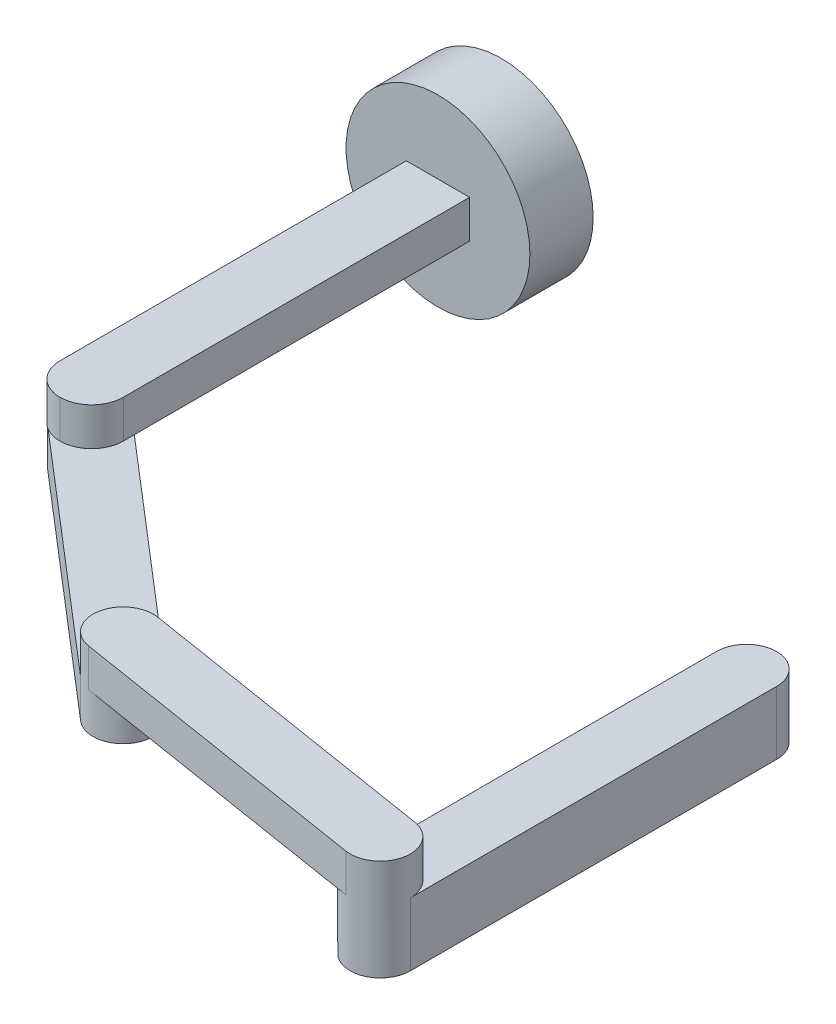
ISO-10303-21;
HEADER;
FILE_DESCRIPTION(('STEP AP214'),'2;1');
FILE_NAME('part.step','',(''),(''),'','','');
FILE_SCHEMA(('AUTOMOTIVE_DESIGN { 1 0 10303 214 1 1 1 1 }'));
ENDSEC;
DATA;
#1=APPLICATION_CONTEXT('core data for automotive mechanical design processes');
#2=APPLICATION_PROTOCOL_DEFINITION('international standard','automotive_design',2000,#1);
#3=PRODUCT_CONTEXT('',#1,'mechanical');
#4=PRODUCT('Part','Part','',(#3));
#5=PRODUCT_RELATED_PRODUCT_CATEGORY('part','',(#4));
#6=PRODUCT_DEFINITION_FORMATION('','',#4);
#7=PRODUCT_DEFINITION_CONTEXT('part definition',#1,'design');
#8=PRODUCT_DEFINITION('design','',#6,#7);
#9=PRODUCT_DEFINITION_SHAPE('','',#8);
#10=(LENGTH_UNIT() NAMED_UNIT(*) SI_UNIT(.MILLI.,.METRE.));
#11=(NAMED_UNIT(*) PLANE_ANGLE_UNIT() SI_UNIT($,.RADIAN.));
#12=(NAMED_UNIT(*) SI_UNIT($,.STERADIAN.) SOLID_ANGLE_UNIT());
#13=UNCERTAINTY_MEASURE_WITH_UNIT(LENGTH_MEASURE(1.E-05),#10,'distance_accuracy_value','');
#14=(GEOMETRIC_REPRESENTATION_CONTEXT(3) GLOBAL_UNCERTAINTY_ASSIGNED_CONTEXT((#13)) GLOBAL_UNIT_ASSIGNED_CONTEXT((#10,
#11,#12)) REPRESENTATION_CONTEXT('',''));
#15=CARTESIAN_POINT('',(0.,0.,0.));
#16=DIRECTION('',(0.,0.,1.));
#17=DIRECTION('',(1.,0.,0.));
#18=AXIS2_PLACEMENT_3D('',#15,#16,#17);
#19=CARTESIAN_POINT('',(74.107497333649,-6.,173.642023366564));
#20=DIRECTION('',(0.,1.,0.));
#21=DIRECTION('',(0.,0.,1.));
#22=AXIS2_PLACEMENT_3D('',#19,#20,#21);
#23=PLANE('',#22);
#24=CARTESIAN_POINT('',(170.904143157306,-6.,189.143321934411));
#25=DIRECTION('',(0.,-1.,0.));
#26=DIRECTION('',(0.,0.,-1.));
#27=AXIS2_PLACEMENT_3D('',#24,#25,#26);
#28=CIRCLE('',#27,9.52576624332074);
#29=CARTESIAN_POINT('',(169.397851750336,-6.,198.549240747567));
#30=VERTEX_POINT('',#29);
#31=CARTESIAN_POINT('',(161.378376913985,-6.,189.143321934411));
#32=VERTEX_POINT('',#31);
#33=EDGE_CURVE('E198',#30,#32,#28,.T.);
#34=ORIENTED_EDGE('',*,*,#33,.F.);
#35=DIRECTION('',(0.987418604750145,0.,0.158128109434332));
#36=VECTOR('',#35,1.);
#37=CARTESIAN_POINT('',(72.6012059266793,-6.,183.04794217972));
#38=LINE('',#37,#36);
#39=CARTESIAN_POINT('',(72.6012059266793,-6.,183.04794217972));
#40=VERTEX_POINT('',#39);
#41=EDGE_CURVE('E220',#40,#30,#38,.T.);
#42=ORIENTED_EDGE('',*,*,#41,.F.);
#43=CARTESIAN_POINT('',(74.107497333649,-6.,173.642023366564));
#44=DIRECTION('',(0.,-1.,0.));
#45=DIRECTION('',(0.,0.,1.));
#46=AXIS2_PLACEMENT_3D('',#43,#44,#45);
#47=CIRCLE('',#46,9.52576624332077);
#48=CARTESIAN_POINT('',(80.3150769859035,-6.,166.416639128802));
#49=VERTEX_POINT('',#48);
#50=EDGE_CURVE('E257',#49,#40,#47,.T.);
#51=ORIENTED_EDGE('',*,*,#50,.F.);
#52=DIRECTION('',(0.758509504978529,0.,0.651661975917904));
#53=VECTOR('',#52,1.);
#54=CARTESIAN_POINT('',(6.20869834950109,-6.,102.749264081622));
#55=LINE('',#54,#53);
#56=CARTESIAN_POINT('',(78.2726264406478,-6.,164.661898615598));
#57=VERTEX_POINT('',#56);
#58=EDGE_CURVE('E253',#57,#49,#55,.T.);
#59=ORIENTED_EDGE('',*,*,#58,.F.);
#60=DIRECTION('',(-0.987418604750146,0.,-0.158128109434332));
#61=VECTOR('',#60,1.);
#62=CARTESIAN_POINT('',(75.6137887406186,-6.,164.236104553408));
#63=LINE('',#62,#61);
#64=CARTESIAN_POINT('',(161.378376913985,-6.,177.970697074784));
#65=VERTEX_POINT('',#64);
#66=EDGE_CURVE('E60',#65,#57,#63,.T.);
#67=ORIENTED_EDGE('',*,*,#66,.F.);
#68=DIRECTION('',(0.,0.,-1.));
#69=VECTOR('',#68,1.);
#70=CARTESIAN_POINT('',(161.378376913985,-6.,189.143321934411));
#71=LINE('',#70,#69);
#72=EDGE_CURVE('E53',#32,#65,#71,.T.);
#73=ORIENTED_EDGE('',*,*,#72,.F.);
#74=EDGE_LOOP('',(#34,#42,#51,#59,#67,#73));
#75=FACE_BOUND('',#74,.T.);
#76=ADVANCED_FACE('F38',(#75),#23,.F.);
#77=CARTESIAN_POINT('',(0.,-6.,109.975950440003));
#78=DIRECTION('',(0.,-1.,0.));
#79=DIRECTION('',(0.,0.,-1.));
#80=AXIS2_PLACEMENT_3D('',#77,#78,#79);
#81=PLANE('',#80);
#82=CARTESIAN_POINT('',(74.107497333649,-6.,173.642023366564));
#83=DIRECTION('',(0.,1.,0.));
#84=DIRECTION('',(0.,0.,1.));
#85=AXIS2_PLACEMENT_3D('',#82,#83,#84);
#86=CIRCLE('',#85,9.52576624332076);
#87=CARTESIAN_POINT('',(75.6137887406186,-6.,164.236104553408));
#88=VERTEX_POINT('',#87);
#89=CARTESIAN_POINT('',(67.8999176813945,-6.,180.867407604326));
#90=VERTEX_POINT('',#89);
#91=EDGE_CURVE('E201',#88,#90,#86,.T.);
#92=ORIENTED_EDGE('',*,*,#91,.F.);
#93=DIRECTION('',(-0.987418604750146,0.,-0.158128109434332));
#94=VECTOR('',#93,1.);
#95=CARTESIAN_POINT('',(-6.58142161251279,-6.,151.073122657815));
#96=LINE('',#95,#94);
#97=EDGE_CURVE('E12',#57,#88,#96,.T.);
#98=ORIENTED_EDGE('',*,*,#97,.F.);
#99=CARTESIAN_POINT('',(10.,-6.,106.006503587059));
#100=VERTEX_POINT('',#99);
#101=EDGE_CURVE('E258',#100,#57,#55,.T.);
#102=ORIENTED_EDGE('',*,*,#101,.F.);
#103=DIRECTION('',(0.,0.,-1.));
#104=VECTOR('',#103,1.);
#105=CARTESIAN_POINT('',(10.,-6.,119.5));
#106=LINE('',#105,#104);
#107=CARTESIAN_POINT('',(10.,-6.,109.5));
#108=VERTEX_POINT('',#107);
#109=EDGE_CURVE('E280',#108,#100,#106,.T.);
#110=ORIENTED_EDGE('',*,*,#109,.F.);
#111=CARTESIAN_POINT('',(0.,-6.,109.5));
#112=DIRECTION('',(0.,-1.,0.));
#113=DIRECTION('',(0.,0.,-1.));
#114=AXIS2_PLACEMENT_3D('',#111,#112,#113);
#115=CIRCLE('',#114,10.);
#116=CARTESIAN_POINT('',(0.,-6.,119.5));
#117=VERTEX_POINT('',#116);
#118=EDGE_CURVE('E312',#108,#117,#115,.T.);
#119=ORIENTED_EDGE('',*,*,#118,.T.);
#120=CARTESIAN_POINT('',(0.,-6.,109.5));
#121=DIRECTION('',(0.,-1.,0.));
#122=DIRECTION('',(0.,0.,-1.));
#123=AXIS2_PLACEMENT_3D('',#120,#121,#122);
#124=CIRCLE('',#123,10.);
#125=CARTESIAN_POINT('',(-5.29500461699873,-6.,117.983096492789));
#126=VERTEX_POINT('',#125);
#127=EDGE_CURVE('E316',#117,#126,#124,.T.);
#128=ORIENTED_EDGE('',*,*,#127,.T.);
#129=DIRECTION('',(-0.75850950497853,0.,-0.651661975917904));
#130=VECTOR('',#129,1.);
#131=CARTESIAN_POINT('',(-6.20646095500788,-6.,117.200032557147));
#132=LINE('',#131,#130);
#133=EDGE_CURVE('E239',#90,#126,#132,.T.);
#134=ORIENTED_EDGE('',*,*,#133,.F.);
#135=EDGE_LOOP('',(#92,#98,#102,#110,#119,#128,#134));
#136=FACE_BOUND('',#135,.T.);
#137=ADVANCED_FACE('F353',(#136),#81,.F.);
#138=CARTESIAN_POINT('',(10.,-6.,119.5));
#139=DIRECTION('',(0.,-1.,0.));
#140=DIRECTION('',(0.,0.,-1.));
#141=AXIS2_PLACEMENT_3D('',#138,#139,#140);
#142=PLANE('',#141);
#143=CARTESIAN_POINT('',(10.,-6.,0.));
#144=VERTEX_POINT('',#143);
#145=EDGE_CURVE('E283',#100,#144,#106,.T.);
#146=ORIENTED_EDGE('',*,*,#145,.F.);
#147=CARTESIAN_POINT('',(6.20869834950109,-6.,102.749264081622));
#148=VERTEX_POINT('',#147);
#149=EDGE_CURVE('E254',#148,#100,#55,.T.);
#150=ORIENTED_EDGE('',*,*,#149,.F.);
#151=DIRECTION('',(0.651661975918026,0.,-0.758509504978424));
#152=VECTOR('',#151,1.);
#153=CARTESIAN_POINT('',(6.20869834950109,-6.,102.749264081622));
#154=LINE('',#153,#152);
#155=CARTESIAN_POINT('',(6.20646095500788,-6.,102.751868322858));
#156=VERTEX_POINT('',#155);
#157=EDGE_CURVE('E250',#156,#148,#154,.T.);
#158=ORIENTED_EDGE('',*,*,#157,.F.);
#159=CARTESIAN_POINT('',(0.,-6.,109.975950440003));
#160=DIRECTION('',(0.,-1.,0.));
#161=DIRECTION('',(0.,0.,-1.));
#162=AXIS2_PLACEMENT_3D('',#159,#160,#161);
#163=CIRCLE('',#162,9.5240495599973);
#164=CARTESIAN_POINT('',(-6.20646095500788,-6.,117.200032557147));
#165=VERTEX_POINT('',#164);
#166=EDGE_CURVE('E234',#165,#156,#163,.T.);
#167=ORIENTED_EDGE('',*,*,#166,.F.);
#168=EDGE_CURVE('E260',#126,#165,#132,.T.);
#169=ORIENTED_EDGE('',*,*,#168,.F.);
#170=CARTESIAN_POINT('',(-10.,-6.,109.5));
#171=VERTEX_POINT('',#170);
#172=EDGE_CURVE('E315',#126,#171,#124,.T.);
#173=ORIENTED_EDGE('',*,*,#172,.T.);
#174=DIRECTION('',(0.,0.,-1.));
#175=VECTOR('',#174,1.);
#176=CARTESIAN_POINT('',(-10.,-6.,119.5));
#177=LINE('',#176,#175);
#178=CARTESIAN_POINT('',(-10.,-6.,0.));
#179=VERTEX_POINT('',#178);
#180=EDGE_CURVE('E277',#171,#179,#177,.T.);
#181=ORIENTED_EDGE('',*,*,#180,.T.);
#182=DIRECTION('',(1.,0.,0.));
#183=VECTOR('',#182,1.);
#184=CARTESIAN_POINT('',(0.,-6.,0.));
#185=LINE('',#184,#183);
#186=EDGE_CURVE('E299',#179,#144,#185,.T.);
#187=ORIENTED_EDGE('',*,*,#186,.T.);
#188=EDGE_LOOP('',(#146,#150,#158,#167,#169,#173,#181,#187));
#189=FACE_BOUND('',#188,.T.);
#190=ADVANCED_FACE('F343',(#189),#142,.T.);
#191=CARTESIAN_POINT('',(0.,0.,-20.));
#192=DIRECTION('',(0.,0.,1.));
#193=DIRECTION('',(1.,0.,0.));
#194=AXIS2_PLACEMENT_3D('',#191,#192,#193);
#195=CYLINDRICAL_SURFACE('',#194,29.0608485526525);
#196=CARTESIAN_POINT('',(0.,0.,-20.));
#197=DIRECTION('',(0.,0.,1.));
#198=DIRECTION('',(1.,0.,0.));
#199=AXIS2_PLACEMENT_3D('',#196,#197,#198);
#200=CIRCLE('',#199,29.0608485526525);
#201=CARTESIAN_POINT('',(29.0608485526525,0.,-20.));
#202=VERTEX_POINT('',#201);
#203=EDGE_CURVE('E288',#202,#202,#200,.T.);
#204=ORIENTED_EDGE('',*,*,#203,.T.);
#205=EDGE_LOOP('',(#204));
#206=FACE_BOUND('',#205,.T.);
#207=CARTESIAN_POINT('',(0.,0.,0.));
#208=DIRECTION('',(0.,0.,1.));
#209=DIRECTION('',(1.,0.,0.));
#210=AXIS2_PLACEMENT_3D('',#207,#208,#209);
#211=CIRCLE('',#210,29.0608485526525);
#212=CARTESIAN_POINT('',(29.0608485526525,0.,0.));
#213=VERTEX_POINT('',#212);
#214=EDGE_CURVE('E279',#213,#213,#211,.T.);
#215=ORIENTED_EDGE('',*,*,#214,.F.);
#216=EDGE_LOOP('',(#215));
#217=FACE_BOUND('',#216,.T.);
#218=ADVANCED_FACE('F592',(#206,#217),#195,.T.);
#219=CARTESIAN_POINT('',(0.,0.,-20.));
#220=DIRECTION('',(0.,0.,1.));
#221=DIRECTION('',(1.,0.,0.));
#222=AXIS2_PLACEMENT_3D('',#219,#220,#221);
#223=PLANE('',#222);
#224=ORIENTED_EDGE('',*,*,#203,.F.);
#225=EDGE_LOOP('',(#224));
#226=FACE_BOUND('',#225,.T.);
#227=ADVANCED_FACE('F615',(#226),#223,.F.);
#228=CARTESIAN_POINT('',(0.,0.,0.));
#229=DIRECTION('',(0.,0.,1.));
#230=DIRECTION('',(1.,0.,0.));
#231=AXIS2_PLACEMENT_3D('',#228,#229,#230);
#232=PLANE('',#231);
#233=DIRECTION('',(0.,-1.,0.));
#234=VECTOR('',#233,1.);
#235=CARTESIAN_POINT('',(-10.,0.,0.));
#236=LINE('',#235,#234);
#237=CARTESIAN_POINT('',(-10.,6.,0.));
#238=VERTEX_POINT('',#237);
#239=EDGE_CURVE('E302',#238,#179,#236,.T.);
#240=ORIENTED_EDGE('',*,*,#239,.F.);
#241=DIRECTION('',(-1.,0.,0.));
#242=VECTOR('',#241,1.);
#243=CARTESIAN_POINT('',(0.,6.,0.));
#244=LINE('',#243,#242);
#245=CARTESIAN_POINT('',(10.,6.,0.));
#246=VERTEX_POINT('',#245);
#247=EDGE_CURVE('E291',#246,#238,#244,.T.);
#248=ORIENTED_EDGE('',*,*,#247,.F.);
#249=DIRECTION('',(0.,1.,0.));
#250=VECTOR('',#249,1.);
#251=CARTESIAN_POINT('',(10.,0.,0.));
#252=LINE('',#251,#250);
#253=EDGE_CURVE('E296',#144,#246,#252,.T.);
#254=ORIENTED_EDGE('',*,*,#253,.F.);
#255=ORIENTED_EDGE('',*,*,#186,.F.);
#256=EDGE_LOOP('',(#240,#248,#254,#255));
#257=FACE_BOUND('',#256,.T.);
#258=ORIENTED_EDGE('',*,*,#214,.T.);
#259=EDGE_LOOP('',(#258));
#260=FACE_BOUND('',#259,.T.);
#261=ADVANCED_FACE('F340',(#257,#260),#232,.T.);
#262=CARTESIAN_POINT('',(-10.,6.,119.5));
#263=DIRECTION('',(-1.,0.,0.));
#264=DIRECTION('',(0.,-1.,0.));
#265=AXIS2_PLACEMENT_3D('',#262,#263,#264);
#266=PLANE('',#265);
#267=ORIENTED_EDGE('',*,*,#180,.F.);
#268=DIRECTION('',(0.,1.,0.));
#269=VECTOR('',#268,1.);
#270=CARTESIAN_POINT('',(-10.,6.,109.5));
#271=LINE('',#270,#269);
#272=CARTESIAN_POINT('',(-10.,6.,109.5));
#273=VERTEX_POINT('',#272);
#274=EDGE_CURVE('E305',#171,#273,#271,.T.);
#275=ORIENTED_EDGE('',*,*,#274,.T.);
#276=DIRECTION('',(0.,0.,-1.));
#277=VECTOR('',#276,1.);
#278=CARTESIAN_POINT('',(-10.,6.,119.5));
#279=LINE('',#278,#277);
#280=EDGE_CURVE('E286',#273,#238,#279,.T.);
#281=ORIENTED_EDGE('',*,*,#280,.T.);
#282=ORIENTED_EDGE('',*,*,#239,.T.);
#283=EDGE_LOOP('',(#267,#275,#281,#282));
#284=FACE_BOUND('',#283,.T.);
#285=ADVANCED_FACE('F347',(#284),#266,.T.);
#286=CARTESIAN_POINT('',(10.,6.,119.5));
#287=DIRECTION('',(1.,0.,0.));
#288=DIRECTION('',(0.,1.,0.));
#289=AXIS2_PLACEMENT_3D('',#286,#287,#288);
#290=PLANE('',#289);
#291=DIRECTION('',(0.,0.,-1.));
#292=VECTOR('',#291,1.);
#293=CARTESIAN_POINT('',(10.,6.,119.5));
#294=LINE('',#293,#292);
#295=CARTESIAN_POINT('',(10.,6.,109.5));
#296=VERTEX_POINT('',#295);
#297=EDGE_CURVE('E284',#296,#246,#294,.T.);
#298=ORIENTED_EDGE('',*,*,#297,.F.);
#299=DIRECTION('',(0.,-1.,0.));
#300=VECTOR('',#299,1.);
#301=CARTESIAN_POINT('',(10.,-6.,109.5));
#302=LINE('',#301,#300);
#303=EDGE_CURVE('E46',#296,#108,#302,.T.);
#304=ORIENTED_EDGE('',*,*,#303,.T.);
#305=ORIENTED_EDGE('',*,*,#109,.T.);
#306=ORIENTED_EDGE('',*,*,#145,.T.);
#307=ORIENTED_EDGE('',*,*,#253,.T.);
#308=EDGE_LOOP('',(#298,#304,#305,#306,#307));
#309=FACE_BOUND('',#308,.T.);
#310=ADVANCED_FACE('F335',(#309),#290,.T.);
#311=CARTESIAN_POINT('',(10.,6.,119.5));
#312=DIRECTION('',(0.,1.,0.));
#313=DIRECTION('',(0.,0.,1.));
#314=AXIS2_PLACEMENT_3D('',#311,#312,#313);
#315=PLANE('',#314);
#316=ORIENTED_EDGE('',*,*,#280,.F.);
#317=CARTESIAN_POINT('',(0.,6.,109.5));
#318=DIRECTION('',(0.,1.,0.));
#319=DIRECTION('',(0.,0.,1.));
#320=AXIS2_PLACEMENT_3D('',#317,#318,#319);
#321=CIRCLE('',#320,10.);
#322=CARTESIAN_POINT('',(0.,6.,119.5));
#323=VERTEX_POINT('',#322);
#324=EDGE_CURVE('E310',#273,#323,#321,.T.);
#325=ORIENTED_EDGE('',*,*,#324,.T.);
#326=CARTESIAN_POINT('',(0.,6.,109.5));
#327=DIRECTION('',(0.,1.,0.));
#328=DIRECTION('',(0.,0.,1.));
#329=AXIS2_PLACEMENT_3D('',#326,#327,#328);
#330=CIRCLE('',#329,10.);
#331=EDGE_CURVE('E308',#323,#296,#330,.T.);
#332=ORIENTED_EDGE('',*,*,#331,.T.);
#333=ORIENTED_EDGE('',*,*,#297,.T.);
#334=ORIENTED_EDGE('',*,*,#247,.T.);
#335=EDGE_LOOP('',(#316,#325,#332,#333,#334));
#336=FACE_BOUND('',#335,.T.);
#337=ADVANCED_FACE('F332',(#336),#315,.T.);
#338=CARTESIAN_POINT('',(0.,6.,109.5));
#339=DIRECTION('',(0.,1.,0.));
#340=DIRECTION('',(-1.,0.,0.));
#341=AXIS2_PLACEMENT_3D('',#338,#339,#340);
#342=CYLINDRICAL_SURFACE('',#341,10.);
#343=DIRECTION('',(0.,-1.,0.));
#344=VECTOR('',#343,1.);
#345=CARTESIAN_POINT('',(0.,6.,119.5));
#346=LINE('',#345,#344);
#347=EDGE_CURVE('E276',#117,#323,#346,.F.);
#348=ORIENTED_EDGE('',*,*,#347,.F.);
#349=ORIENTED_EDGE('',*,*,#118,.F.);
#350=ORIENTED_EDGE('',*,*,#303,.F.);
#351=ORIENTED_EDGE('',*,*,#331,.F.);
#352=EDGE_LOOP('',(#348,#349,#350,#351));
#353=FACE_BOUND('',#352,.T.);
#354=ADVANCED_FACE('F40',(#353),#342,.T.);
#355=CARTESIAN_POINT('',(0.,6.,109.5));
#356=DIRECTION('',(0.,-1.,0.));
#357=DIRECTION('',(1.,0.,0.));
#358=AXIS2_PLACEMENT_3D('',#355,#356,#357);
#359=CYLINDRICAL_SURFACE('',#358,10.);
#360=ORIENTED_EDGE('',*,*,#127,.F.);
#361=ORIENTED_EDGE('',*,*,#347,.T.);
#362=ORIENTED_EDGE('',*,*,#324,.F.);
#363=ORIENTED_EDGE('',*,*,#274,.F.);
#364=ORIENTED_EDGE('',*,*,#172,.F.);
#365=EDGE_LOOP('',(#360,#361,#362,#363,#364));
#366=FACE_BOUND('',#365,.T.);
#367=ADVANCED_FACE('F322',(#366),#359,.T.);
#368=CARTESIAN_POINT('',(0.,-18.,109.975950440003));
#369=DIRECTION('',(0.,1.,0.));
#370=DIRECTION('',(0.,0.,1.));
#371=AXIS2_PLACEMENT_3D('',#368,#369,#370);
#372=CYLINDRICAL_SURFACE('',#371,9.5240495599973);
#373=ORIENTED_EDGE('',*,*,#166,.T.);
#374=DIRECTION('',(0.,1.,0.));
#375=VECTOR('',#374,1.);
#376=CARTESIAN_POINT('',(6.20646095500788,-18.,102.751868322858));
#377=LINE('',#376,#375);
#378=CARTESIAN_POINT('',(6.20646095500788,-18.,102.751868322858));
#379=VERTEX_POINT('',#378);
#380=EDGE_CURVE('E273',#379,#156,#377,.T.);
#381=ORIENTED_EDGE('',*,*,#380,.F.);
#382=CARTESIAN_POINT('',(0.,-18.,109.975950440003));
#383=DIRECTION('',(0.,-1.,0.));
#384=DIRECTION('',(0.,0.,-1.));
#385=AXIS2_PLACEMENT_3D('',#382,#383,#384);
#386=CIRCLE('',#385,9.5240495599973);
#387=CARTESIAN_POINT('',(-6.20646095500788,-18.,117.200032557147));
#388=VERTEX_POINT('',#387);
#389=EDGE_CURVE('E235',#388,#379,#386,.T.);
#390=ORIENTED_EDGE('',*,*,#389,.F.);
#391=DIRECTION('',(0.,1.,0.));
#392=VECTOR('',#391,1.);
#393=CARTESIAN_POINT('',(-6.20646095500788,-18.,117.200032557147));
#394=LINE('',#393,#392);
#395=EDGE_CURVE('E247',#388,#165,#394,.T.);
#396=ORIENTED_EDGE('',*,*,#395,.T.);
#397=EDGE_LOOP('',(#373,#381,#390,#396));
#398=FACE_BOUND('',#397,.T.);
#399=ADVANCED_FACE('F395',(#398),#372,.T.);
#400=CARTESIAN_POINT('',(6.20869834950109,-18.,102.749264081622));
#401=DIRECTION('',(0.758509504978424,0.,0.651661975918026));
#402=DIRECTION('',(0.651661975918026,0.,-0.758509504978424));
#403=AXIS2_PLACEMENT_3D('',#400,#401,#402);
#404=PLANE('',#403);
#405=ORIENTED_EDGE('',*,*,#157,.T.);
#406=DIRECTION('',(0.,1.,0.));
#407=VECTOR('',#406,1.);
#408=CARTESIAN_POINT('',(6.20869834950109,-18.,102.749264081622));
#409=LINE('',#408,#407);
#410=CARTESIAN_POINT('',(6.20869834950109,-18.,102.749264081622));
#411=VERTEX_POINT('',#410);
#412=EDGE_CURVE('E270',#411,#148,#409,.T.);
#413=ORIENTED_EDGE('',*,*,#412,.F.);
#414=DIRECTION('',(0.651661975918026,0.,-0.758509504978424));
#415=VECTOR('',#414,1.);
#416=CARTESIAN_POINT('',(6.20869834950109,-18.,102.749264081622));
#417=LINE('',#416,#415);
#418=EDGE_CURVE('E238',#379,#411,#417,.T.);
#419=ORIENTED_EDGE('',*,*,#418,.F.);
#420=ORIENTED_EDGE('',*,*,#380,.T.);
#421=EDGE_LOOP('',(#405,#413,#419,#420));
#422=FACE_BOUND('',#421,.T.);
#423=ADVANCED_FACE('F391',(#422),#404,.F.);
#424=CARTESIAN_POINT('',(6.20869834950109,-18.,102.749264081622));
#425=DIRECTION('',(-0.651661975917904,0.,0.758509504978529));
#426=DIRECTION('',(0.758509504978529,0.,0.651661975917904));
#427=AXIS2_PLACEMENT_3D('',#424,#425,#426);
#428=PLANE('',#427);
#429=ORIENTED_EDGE('',*,*,#149,.T.);
#430=ORIENTED_EDGE('',*,*,#101,.T.);
#431=ORIENTED_EDGE('',*,*,#58,.T.);
#432=DIRECTION('',(0.,1.,0.));
#433=VECTOR('',#432,1.);
#434=CARTESIAN_POINT('',(80.3150769859035,-18.,166.416639128802));
#435=LINE('',#434,#433);
#436=CARTESIAN_POINT('',(80.3150769859035,-18.,166.416639128802));
#437=VERTEX_POINT('',#436);
#438=EDGE_CURVE('E267',#437,#49,#435,.T.);
#439=ORIENTED_EDGE('',*,*,#438,.F.);
#440=DIRECTION('',(0.758509504978529,0.,0.651661975917904));
#441=VECTOR('',#440,1.);
#442=CARTESIAN_POINT('',(6.20869834950109,-18.,102.749264081622));
#443=LINE('',#442,#441);
#444=EDGE_CURVE('E241',#411,#437,#443,.T.);
#445=ORIENTED_EDGE('',*,*,#444,.F.);
#446=ORIENTED_EDGE('',*,*,#412,.T.);
#447=EDGE_LOOP('',(#429,#430,#431,#439,#445,#446));
#448=FACE_BOUND('',#447,.T.);
#449=ADVANCED_FACE('F387',(#448),#428,.F.);
#450=CARTESIAN_POINT('',(74.107497333649,-18.,173.642023366564));
#451=DIRECTION('',(0.,1.,0.));
#452=DIRECTION('',(0.,0.,1.));
#453=AXIS2_PLACEMENT_3D('',#450,#451,#452);
#454=CYLINDRICAL_SURFACE('',#453,9.52576624332077);
#455=ORIENTED_EDGE('',*,*,#50,.T.);
#456=DIRECTION('',(0.,-1.,0.));
#457=VECTOR('',#456,1.);
#458=CARTESIAN_POINT('',(72.6012059266793,6.,183.04794217972));
#459=LINE('',#458,#457);
#460=CARTESIAN_POINT('',(72.6012059266793,6.,183.04794217972));
#461=VERTEX_POINT('',#460);
#462=EDGE_CURVE('E231',#461,#40,#459,.T.);
#463=ORIENTED_EDGE('',*,*,#462,.F.);
#464=CARTESIAN_POINT('',(74.107497333649,6.,173.642023366564));
#465=DIRECTION('',(0.,1.,0.));
#466=DIRECTION('',(0.,0.,1.));
#467=AXIS2_PLACEMENT_3D('',#464,#465,#466);
#468=CIRCLE('',#467,9.52576624332076);
#469=CARTESIAN_POINT('',(75.6137887406186,6.,164.236104553408));
#470=VERTEX_POINT('',#469);
#471=EDGE_CURVE('E207',#470,#461,#468,.T.);
#472=ORIENTED_EDGE('',*,*,#471,.F.);
#473=DIRECTION('',(0.,-1.,0.));
#474=VECTOR('',#473,1.);
#475=CARTESIAN_POINT('',(75.6137887406186,6.,164.236104553408));
#476=LINE('',#475,#474);
#477=EDGE_CURVE('E217',#470,#88,#476,.T.);
#478=ORIENTED_EDGE('',*,*,#477,.T.);
#479=ORIENTED_EDGE('',*,*,#91,.T.);
#480=DIRECTION('',(0.,1.,0.));
#481=VECTOR('',#480,1.);
#482=CARTESIAN_POINT('',(67.8999176813945,-18.,180.867407604326));
#483=LINE('',#482,#481);
#484=CARTESIAN_POINT('',(67.8999176813945,-18.,180.867407604326));
#485=VERTEX_POINT('',#484);
#486=EDGE_CURVE('E265',#485,#90,#483,.T.);
#487=ORIENTED_EDGE('',*,*,#486,.F.);
#488=CARTESIAN_POINT('',(74.107497333649,-18.,173.642023366564));
#489=DIRECTION('',(0.,-1.,0.));
#490=DIRECTION('',(0.,0.,1.));
#491=AXIS2_PLACEMENT_3D('',#488,#489,#490);
#492=CIRCLE('',#491,9.52576624332077);
#493=EDGE_CURVE('E243',#437,#485,#492,.T.);
#494=ORIENTED_EDGE('',*,*,#493,.F.);
#495=ORIENTED_EDGE('',*,*,#438,.T.);
#496=EDGE_LOOP('',(#455,#463,#472,#478,#479,#487,#494,#495));
#497=FACE_BOUND('',#496,.T.);
#498=ADVANCED_FACE('F359',(#497),#454,.T.);
#499=CARTESIAN_POINT('',(-6.20646095500788,-18.,117.200032557147));
#500=DIRECTION('',(0.651661975917903,0.,-0.758509504978529));
#501=DIRECTION('',(-0.75850950497853,0.,-0.651661975917903));
#502=AXIS2_PLACEMENT_3D('',#499,#500,#501);
#503=PLANE('',#502);
#504=ORIENTED_EDGE('',*,*,#133,.T.);
#505=ORIENTED_EDGE('',*,*,#168,.T.);
#506=ORIENTED_EDGE('',*,*,#395,.F.);
#507=DIRECTION('',(-0.75850950497853,0.,-0.651661975917904));
#508=VECTOR('',#507,1.);
#509=CARTESIAN_POINT('',(-6.20646095500788,-18.,117.200032557147));
#510=LINE('',#509,#508);
#511=EDGE_CURVE('E245',#485,#388,#510,.T.);
#512=ORIENTED_EDGE('',*,*,#511,.F.);
#513=ORIENTED_EDGE('',*,*,#486,.T.);
#514=EDGE_LOOP('',(#504,#505,#506,#512,#513));
#515=FACE_BOUND('',#514,.T.);
#516=ADVANCED_FACE('F354',(#515),#503,.F.);
#517=CARTESIAN_POINT('',(0.,-18.,109.975950440003));
#518=DIRECTION('',(0.,-1.,0.));
#519=DIRECTION('',(0.,0.,-1.));
#520=AXIS2_PLACEMENT_3D('',#517,#518,#519);
#521=PLANE('',#520);
#522=ORIENTED_EDGE('',*,*,#389,.T.);
#523=ORIENTED_EDGE('',*,*,#418,.T.);
#524=ORIENTED_EDGE('',*,*,#444,.T.);
#525=ORIENTED_EDGE('',*,*,#493,.T.);
#526=ORIENTED_EDGE('',*,*,#511,.T.);
#527=EDGE_LOOP('',(#522,#523,#524,#525,#526));
#528=FACE_BOUND('',#527,.T.);
#529=ADVANCED_FACE('F397',(#528),#521,.T.);
#530=CARTESIAN_POINT('',(72.6012059266793,6.,183.04794217972));
#531=DIRECTION('',(0.158128109434332,0.,-0.987418604750146));
#532=DIRECTION('',(-0.987418604750146,0.,-0.158128109434332));
#533=AXIS2_PLACEMENT_3D('',#530,#531,#532);
#534=PLANE('',#533);
#535=ORIENTED_EDGE('',*,*,#41,.T.);
#536=DIRECTION('',(0.,-1.,0.));
#537=VECTOR('',#536,1.);
#538=CARTESIAN_POINT('',(169.397851750336,6.,198.549240747567));
#539=LINE('',#538,#537);
#540=CARTESIAN_POINT('',(169.397851750336,6.,198.549240747567));
#541=VERTEX_POINT('',#540);
#542=EDGE_CURVE('E229',#541,#30,#539,.T.);
#543=ORIENTED_EDGE('',*,*,#542,.F.);
#544=DIRECTION('',(0.987418604750145,0.,0.158128109434332));
#545=VECTOR('',#544,1.);
#546=CARTESIAN_POINT('',(72.6012059266793,6.,183.04794217972));
#547=LINE('',#546,#545);
#548=EDGE_CURVE('E210',#461,#541,#547,.T.);
#549=ORIENTED_EDGE('',*,*,#548,.F.);
#550=ORIENTED_EDGE('',*,*,#462,.T.);
#551=EDGE_LOOP('',(#535,#543,#549,#550));
#552=FACE_BOUND('',#551,.T.);
#553=ADVANCED_FACE('F399',(#552),#534,.F.);
#554=CARTESIAN_POINT('',(170.904143157306,6.,189.143321934411));
#555=DIRECTION('',(0.,-1.,0.));
#556=DIRECTION('',(0.,0.,-1.));
#557=AXIS2_PLACEMENT_3D('',#554,#555,#556);
#558=CYLINDRICAL_SURFACE('',#557,9.52576624332074);
#559=ORIENTED_EDGE('',*,*,#542,.T.);
#560=ORIENTED_EDGE('',*,*,#33,.T.);
#561=DIRECTION('',(0.,1.,0.));
#562=VECTOR('',#561,1.);
#563=CARTESIAN_POINT('',(161.378376913985,-26.,189.143321934411));
#564=LINE('',#563,#562);
#565=CARTESIAN_POINT('',(161.378376913985,-26.,189.143321934411));
#566=VERTEX_POINT('',#565);
#567=EDGE_CURVE('E179',#566,#32,#564,.T.);
#568=ORIENTED_EDGE('',*,*,#567,.F.);
#569=CARTESIAN_POINT('',(170.904143157306,-26.,189.143321934411));
#570=DIRECTION('',(0.,-1.,0.));
#571=DIRECTION('',(0.,0.,-1.));
#572=AXIS2_PLACEMENT_3D('',#569,#570,#571);
#573=CIRCLE('',#572,9.52576624332074);
#574=CARTESIAN_POINT('',(180.429909400626,-26.,189.143321934411));
#575=VERTEX_POINT('',#574);
#576=EDGE_CURVE('E185',#575,#566,#573,.T.);
#577=ORIENTED_EDGE('',*,*,#576,.F.);
#578=DIRECTION('',(0.,1.,0.));
#579=VECTOR('',#578,1.);
#580=CARTESIAN_POINT('',(180.429909400626,-26.,189.143321934411));
#581=LINE('',#580,#579);
#582=CARTESIAN_POINT('',(180.429909400626,-6.,189.143321934411));
#583=VERTEX_POINT('',#582);
#584=EDGE_CURVE('E442',#575,#583,#581,.T.);
#585=ORIENTED_EDGE('',*,*,#584,.T.);
#586=CARTESIAN_POINT('',(170.904143157306,-6.,189.143321934411));
#587=DIRECTION('',(0.,-1.,0.));
#588=DIRECTION('',(0.,0.,-1.));
#589=AXIS2_PLACEMENT_3D('',#586,#587,#588);
#590=CIRCLE('',#589,9.52576624332074);
#591=CARTESIAN_POINT('',(172.410434564275,-6.,179.737403121256));
#592=VERTEX_POINT('',#591);
#593=EDGE_CURVE('E199',#592,#583,#590,.T.);
#594=ORIENTED_EDGE('',*,*,#593,.F.);
#595=DIRECTION('',(0.,-1.,0.));
#596=VECTOR('',#595,1.);
#597=CARTESIAN_POINT('',(172.410434564275,6.,179.737403121256));
#598=LINE('',#597,#596);
#599=CARTESIAN_POINT('',(172.410434564275,6.,179.737403121256));
#600=VERTEX_POINT('',#599);
#601=EDGE_CURVE('E226',#600,#592,#598,.T.);
#602=ORIENTED_EDGE('',*,*,#601,.F.);
#603=CARTESIAN_POINT('',(170.904143157306,6.,189.143321934411));
#604=DIRECTION('',(0.,1.,0.));
#605=DIRECTION('',(0.,0.,1.));
#606=AXIS2_PLACEMENT_3D('',#603,#604,#605);
#607=CIRCLE('',#606,9.52576624332074);
#608=EDGE_CURVE('E213',#541,#600,#607,.T.);
#609=ORIENTED_EDGE('',*,*,#608,.F.);
#610=EDGE_LOOP('',(#559,#560,#568,#577,#585,#594,#602,#609));
#611=FACE_BOUND('',#610,.T.);
#612=ADVANCED_FACE('F197',(#611),#558,.T.);
#613=CARTESIAN_POINT('',(75.6137887406186,6.,164.236104553408));
#614=DIRECTION('',(-0.158128109434332,0.,0.987418604750145));
#615=DIRECTION('',(0.987418604750146,0.,0.158128109434332));
#616=AXIS2_PLACEMENT_3D('',#613,#614,#615);
#617=PLANE('',#616);
#618=EDGE_CURVE('E211',#592,#65,#63,.T.);
#619=ORIENTED_EDGE('',*,*,#618,.T.);
#620=ORIENTED_EDGE('',*,*,#66,.T.);
#621=ORIENTED_EDGE('',*,*,#97,.T.);
#622=ORIENTED_EDGE('',*,*,#477,.F.);
#623=DIRECTION('',(-0.987418604750146,0.,-0.158128109434332));
#624=VECTOR('',#623,1.);
#625=CARTESIAN_POINT('',(75.6137887406186,6.,164.236104553408));
#626=LINE('',#625,#624);
#627=EDGE_CURVE('E215',#600,#470,#626,.T.);
#628=ORIENTED_EDGE('',*,*,#627,.F.);
#629=ORIENTED_EDGE('',*,*,#601,.T.);
#630=EDGE_LOOP('',(#619,#620,#621,#622,#628,#629));
#631=FACE_BOUND('',#630,.T.);
#632=ADVANCED_FACE('F364',(#631),#617,.F.);
#633=CARTESIAN_POINT('',(74.107497333649,6.,173.642023366564));
#634=DIRECTION('',(0.,1.,0.));
#635=DIRECTION('',(0.,0.,1.));
#636=AXIS2_PLACEMENT_3D('',#633,#634,#635);
#637=PLANE('',#636);
#638=ORIENTED_EDGE('',*,*,#471,.T.);
#639=ORIENTED_EDGE('',*,*,#548,.T.);
#640=ORIENTED_EDGE('',*,*,#608,.T.);
#641=ORIENTED_EDGE('',*,*,#627,.T.);
#642=EDGE_LOOP('',(#638,#639,#640,#641));
#643=FACE_BOUND('',#642,.T.);
#644=ADVANCED_FACE('F368',(#643),#637,.T.);
#645=CARTESIAN_POINT('',(170.904143157306,-6.,189.143321934411));
#646=DIRECTION('',(0.,-1.,0.));
#647=DIRECTION('',(0.,0.,-1.));
#648=AXIS2_PLACEMENT_3D('',#645,#646,#647);
#649=PLANE('',#648);
#650=ORIENTED_EDGE('',*,*,#618,.F.);
#651=ORIENTED_EDGE('',*,*,#593,.T.);
#652=DIRECTION('',(0.,0.,1.));
#653=VECTOR('',#652,1.);
#654=CARTESIAN_POINT('',(180.429909400626,-6.,189.143321934411));
#655=LINE('',#654,#653);
#656=CARTESIAN_POINT('',(180.429909400626,-6.,73.3433219344115));
#657=VERTEX_POINT('',#656);
#658=EDGE_CURVE('E194',#657,#583,#655,.T.);
#659=ORIENTED_EDGE('',*,*,#658,.F.);
#660=CARTESIAN_POINT('',(170.904143157306,-6.,73.3433219344115));
#661=DIRECTION('',(0.,-1.,0.));
#662=DIRECTION('',(0.,0.,-1.));
#663=AXIS2_PLACEMENT_3D('',#660,#661,#662);
#664=CIRCLE('',#663,9.52576624332074);
#665=CARTESIAN_POINT('',(161.378376913985,-6.,73.3433219344115));
#666=VERTEX_POINT('',#665);
#667=EDGE_CURVE('E379',#666,#657,#664,.T.);
#668=ORIENTED_EDGE('',*,*,#667,.F.);
#669=EDGE_CURVE('E378',#65,#666,#71,.T.);
#670=ORIENTED_EDGE('',*,*,#669,.F.);
#671=EDGE_LOOP('',(#650,#651,#659,#668,#670));
#672=FACE_BOUND('',#671,.T.);
#673=ADVANCED_FACE('F374',(#672),#649,.F.);
#674=CARTESIAN_POINT('',(161.378376913985,-26.,189.143321934411));
#675=DIRECTION('',(1.,0.,0.));
#676=DIRECTION('',(0.,0.,-1.));
#677=AXIS2_PLACEMENT_3D('',#674,#675,#676);
#678=PLANE('',#677);
#679=ORIENTED_EDGE('',*,*,#72,.T.);
#680=ORIENTED_EDGE('',*,*,#669,.T.);
#681=DIRECTION('',(0.,1.,0.));
#682=VECTOR('',#681,1.);
#683=CARTESIAN_POINT('',(161.378376913985,-26.,73.3433219344115));
#684=LINE('',#683,#682);
#685=CARTESIAN_POINT('',(161.378376913985,-26.,73.3433219344115));
#686=VERTEX_POINT('',#685);
#687=EDGE_CURVE('E181',#686,#666,#684,.T.);
#688=ORIENTED_EDGE('',*,*,#687,.F.);
#689=DIRECTION('',(0.,0.,-1.));
#690=VECTOR('',#689,1.);
#691=CARTESIAN_POINT('',(161.378376913985,-26.,189.143321934411));
#692=LINE('',#691,#690);
#693=EDGE_CURVE('E175',#566,#686,#692,.T.);
#694=ORIENTED_EDGE('',*,*,#693,.F.);
#695=ORIENTED_EDGE('',*,*,#567,.T.);
#696=EDGE_LOOP('',(#679,#680,#688,#694,#695));
#697=FACE_BOUND('',#696,.T.);
#698=ADVANCED_FACE('F177',(#697),#678,.F.);
#699=CARTESIAN_POINT('',(170.904143157306,-26.,73.3433219344115));
#700=DIRECTION('',(0.,1.,0.));
#701=DIRECTION('',(0.,0.,1.));
#702=AXIS2_PLACEMENT_3D('',#699,#700,#701);
#703=CYLINDRICAL_SURFACE('',#702,9.52576624332074);
#704=ORIENTED_EDGE('',*,*,#667,.T.);
#705=DIRECTION('',(0.,1.,0.));
#706=VECTOR('',#705,1.);
#707=CARTESIAN_POINT('',(180.429909400626,-26.,73.3433219344115));
#708=LINE('',#707,#706);
#709=CARTESIAN_POINT('',(180.429909400626,-26.,73.3433219344115));
#710=VERTEX_POINT('',#709);
#711=EDGE_CURVE('E203',#710,#657,#708,.T.);
#712=ORIENTED_EDGE('',*,*,#711,.F.);
#713=CARTESIAN_POINT('',(170.904143157306,-26.,73.3433219344115));
#714=DIRECTION('',(0.,-1.,0.));
#715=DIRECTION('',(0.,0.,-1.));
#716=AXIS2_PLACEMENT_3D('',#713,#714,#715);
#717=CIRCLE('',#716,9.52576624332074);
#718=EDGE_CURVE('E184',#686,#710,#717,.T.);
#719=ORIENTED_EDGE('',*,*,#718,.F.);
#720=ORIENTED_EDGE('',*,*,#687,.T.);
#721=EDGE_LOOP('',(#704,#712,#719,#720));
#722=FACE_BOUND('',#721,.T.);
#723=ADVANCED_FACE('F428',(#722),#703,.T.);
#724=CARTESIAN_POINT('',(180.429909400626,-26.,189.143321934411));
#725=DIRECTION('',(-1.,0.,0.));
#726=DIRECTION('',(0.,0.,1.));
#727=AXIS2_PLACEMENT_3D('',#724,#725,#726);
#728=PLANE('',#727);
#729=ORIENTED_EDGE('',*,*,#658,.T.);
#730=ORIENTED_EDGE('',*,*,#584,.F.);
#731=DIRECTION('',(0.,0.,1.));
#732=VECTOR('',#731,1.);
#733=CARTESIAN_POINT('',(180.429909400626,-26.,189.143321934411));
#734=LINE('',#733,#732);
#735=EDGE_CURVE('E190',#710,#575,#734,.T.);
#736=ORIENTED_EDGE('',*,*,#735,.F.);
#737=ORIENTED_EDGE('',*,*,#711,.T.);
#738=EDGE_LOOP('',(#729,#730,#736,#737));
#739=FACE_BOUND('',#738,.T.);
#740=ADVANCED_FACE('F431',(#739),#728,.F.);
#741=CARTESIAN_POINT('',(170.904143157306,-26.,189.143321934411));
#742=DIRECTION('',(0.,-1.,0.));
#743=DIRECTION('',(0.,0.,-1.));
#744=AXIS2_PLACEMENT_3D('',#741,#742,#743);
#745=PLANE('',#744);
#746=ORIENTED_EDGE('',*,*,#576,.T.);
#747=ORIENTED_EDGE('',*,*,#693,.T.);
#748=ORIENTED_EDGE('',*,*,#718,.T.);
#749=ORIENTED_EDGE('',*,*,#735,.T.);
#750=EDGE_LOOP('',(#746,#747,#748,#749));
#751=FACE_BOUND('',#750,.T.);
#752=ADVANCED_FACE('F188',(#751),#745,.T.);
#753=CLOSED_SHELL('',(#76,#137,#190,#218,#227,#261,#285,#310,#337,#354,#367,#399,#423,#449,#498,
#516,#529,#553,#612,#632,#644,#673,#698,#723,#740,#752));
#754=MANIFOLD_SOLID_BREP('B2',#753);
#755=ADVANCED_BREP_SHAPE_REPRESENTATION('',(#18,#754),#14);
#756=SHAPE_DEFINITION_REPRESENTATION(#9,#755);
ENDSEC;
END-ISO-10303-21;
